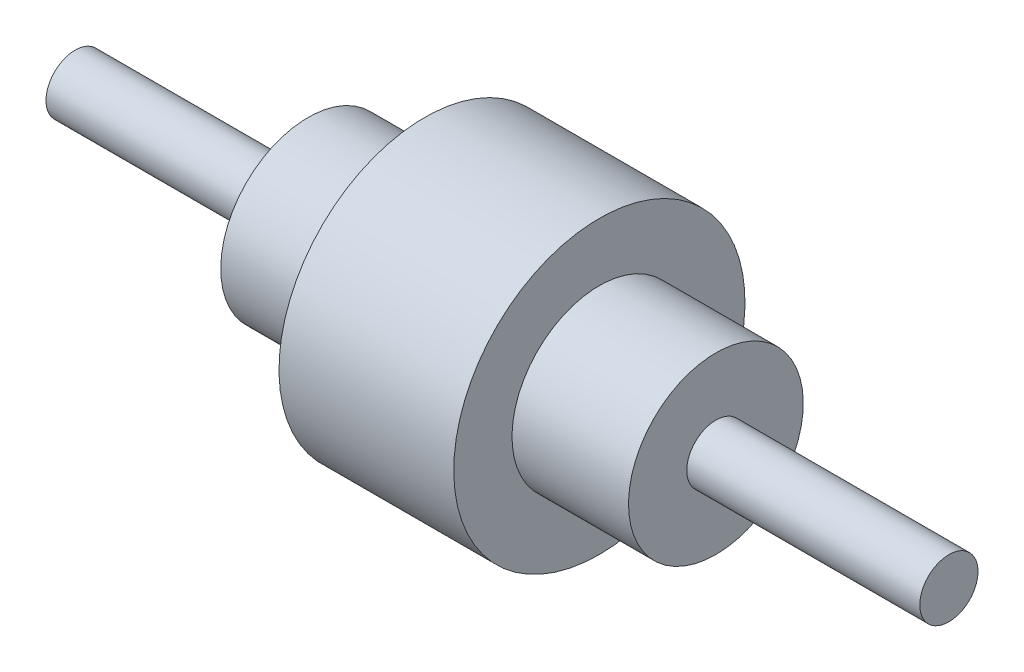
ISO-10303-21;
HEADER;
FILE_DESCRIPTION(('STEP AP214'),'2;1');
FILE_NAME('part.step','',(''),(''),'','','');
FILE_SCHEMA(('AUTOMOTIVE_DESIGN { 1 0 10303 214 1 1 1 1 }'));
ENDSEC;
DATA;
#1=APPLICATION_CONTEXT('core data for automotive mechanical design processes');
#2=APPLICATION_PROTOCOL_DEFINITION('international standard','automotive_design',2000,#1);
#3=PRODUCT_CONTEXT('',#1,'mechanical');
#4=PRODUCT('Part','Part','',(#3));
#5=PRODUCT_RELATED_PRODUCT_CATEGORY('part','',(#4));
#6=PRODUCT_DEFINITION_FORMATION('','',#4);
#7=PRODUCT_DEFINITION_CONTEXT('part definition',#1,'design');
#8=PRODUCT_DEFINITION('design','',#6,#7);
#9=PRODUCT_DEFINITION_SHAPE('','',#8);
#10=(LENGTH_UNIT() NAMED_UNIT(*) SI_UNIT(.MILLI.,.METRE.));
#11=(NAMED_UNIT(*) PLANE_ANGLE_UNIT() SI_UNIT($,.RADIAN.));
#12=(NAMED_UNIT(*) SI_UNIT($,.STERADIAN.) SOLID_ANGLE_UNIT());
#13=UNCERTAINTY_MEASURE_WITH_UNIT(LENGTH_MEASURE(1.E-05),#10,'distance_accuracy_value','');
#14=(GEOMETRIC_REPRESENTATION_CONTEXT(3) GLOBAL_UNCERTAINTY_ASSIGNED_CONTEXT((#13)) GLOBAL_UNIT_ASSIGNED_CONTEXT((#10,
#11,#12)) REPRESENTATION_CONTEXT('',''));
#15=CARTESIAN_POINT('',(0.,0.,0.));
#16=DIRECTION('',(0.,0.,1.));
#17=DIRECTION('',(1.,0.,0.));
#18=AXIS2_PLACEMENT_3D('',#15,#16,#17);
#19=CARTESIAN_POINT('',(-337.196685693784,0.,0.));
#20=DIRECTION('',(-1.,0.,0.));
#21=DIRECTION('',(0.,-1.,0.));
#22=AXIS2_PLACEMENT_3D('',#19,#20,#21);
#23=CYLINDRICAL_SURFACE('',#22,9.99999999999999);
#24=CARTESIAN_POINT('',(80.,0.,0.));
#25=DIRECTION('',(-1.,0.,0.));
#26=DIRECTION('',(0.,-1.,0.));
#27=AXIS2_PLACEMENT_3D('',#24,#25,#26);
#28=CIRCLE('',#27,9.99999999999999);
#29=CARTESIAN_POINT('',(80.,-10.,0.));
#30=VERTEX_POINT('',#29);
#31=EDGE_CURVE('E10',#30,#30,#28,.T.);
#32=ORIENTED_EDGE('',*,*,#31,.T.);
#33=EDGE_LOOP('',(#32));
#34=FACE_BOUND('',#33,.T.);
#35=CARTESIAN_POINT('',(0.,0.,0.));
#36=DIRECTION('',(-1.,0.,0.));
#37=DIRECTION('',(0.,-1.,0.));
#38=AXIS2_PLACEMENT_3D('',#35,#36,#37);
#39=CIRCLE('',#38,9.99999999999999);
#40=CARTESIAN_POINT('',(0.,-10.,0.));
#41=VERTEX_POINT('',#40);
#42=EDGE_CURVE('E65',#41,#41,#39,.T.);
#43=ORIENTED_EDGE('',*,*,#42,.F.);
#44=EDGE_LOOP('',(#43));
#45=FACE_BOUND('',#44,.T.);
#46=ADVANCED_FACE('F31',(#34,#45),#23,.T.);
#47=CARTESIAN_POINT('',(80.,-10.,0.));
#48=DIRECTION('',(1.,0.,0.));
#49=DIRECTION('',(0.,1.,0.));
#50=AXIS2_PLACEMENT_3D('',#47,#48,#49);
#51=PLANE('',#50);
#52=ORIENTED_EDGE('',*,*,#31,.F.);
#53=EDGE_LOOP('',(#52));
#54=FACE_BOUND('',#53,.T.);
#55=ADVANCED_FACE('F73',(#54),#51,.T.);
#56=CARTESIAN_POINT('',(-220.,0.,0.));
#57=DIRECTION('',(-1.,0.,0.));
#58=DIRECTION('',(0.,-1.,0.));
#59=AXIS2_PLACEMENT_3D('',#56,#57,#58);
#60=PLANE('',#59);
#61=CARTESIAN_POINT('',(-220.,0.,0.));
#62=DIRECTION('',(-1.,0.,0.));
#63=DIRECTION('',(0.,-1.,0.));
#64=AXIS2_PLACEMENT_3D('',#61,#62,#63);
#65=CIRCLE('',#64,10.);
#66=CARTESIAN_POINT('',(-220.,-10.,0.));
#67=VERTEX_POINT('',#66);
#68=EDGE_CURVE('E37',#67,#67,#65,.T.);
#69=ORIENTED_EDGE('',*,*,#68,.T.);
#70=EDGE_LOOP('',(#69));
#71=FACE_BOUND('',#70,.T.);
#72=ADVANCED_FACE('F77',(#71),#60,.T.);
#73=CARTESIAN_POINT('',(-337.196685693784,0.,0.));
#74=DIRECTION('',(-1.,0.,0.));
#75=DIRECTION('',(0.,-1.,0.));
#76=AXIS2_PLACEMENT_3D('',#73,#74,#75);
#77=CYLINDRICAL_SURFACE('',#76,10.);
#78=CARTESIAN_POINT('',(-140.,0.,0.));
#79=DIRECTION('',(-1.,0.,0.));
#80=DIRECTION('',(0.,-1.,0.));
#81=AXIS2_PLACEMENT_3D('',#78,#79,#80);
#82=CIRCLE('',#81,10.);
#83=CARTESIAN_POINT('',(-140.,-10.,0.));
#84=VERTEX_POINT('',#83);
#85=EDGE_CURVE('E41',#84,#84,#82,.T.);
#86=ORIENTED_EDGE('',*,*,#85,.T.);
#87=EDGE_LOOP('',(#86));
#88=FACE_BOUND('',#87,.T.);
#89=ORIENTED_EDGE('',*,*,#68,.F.);
#90=EDGE_LOOP('',(#89));
#91=FACE_BOUND('',#90,.T.);
#92=ADVANCED_FACE('F82',(#88,#91),#77,.T.);
#93=CARTESIAN_POINT('',(-140.,-10.,0.));
#94=DIRECTION('',(-1.,0.,0.));
#95=DIRECTION('',(0.,-1.,0.));
#96=AXIS2_PLACEMENT_3D('',#93,#94,#95);
#97=PLANE('',#96);
#98=CARTESIAN_POINT('',(-140.,0.,0.));
#99=DIRECTION('',(-1.,0.,0.));
#100=DIRECTION('',(0.,-1.,0.));
#101=AXIS2_PLACEMENT_3D('',#98,#99,#100);
#102=CIRCLE('',#101,30.);
#103=CARTESIAN_POINT('',(-140.,-30.,0.));
#104=VERTEX_POINT('',#103);
#105=EDGE_CURVE('E45',#104,#104,#102,.T.);
#106=ORIENTED_EDGE('',*,*,#105,.T.);
#107=EDGE_LOOP('',(#106));
#108=FACE_BOUND('',#107,.T.);
#109=ORIENTED_EDGE('',*,*,#85,.F.);
#110=EDGE_LOOP('',(#109));
#111=FACE_BOUND('',#110,.T.);
#112=ADVANCED_FACE('F87',(#108,#111),#97,.T.);
#113=CARTESIAN_POINT('',(-337.196685693784,0.,0.));
#114=DIRECTION('',(-1.,0.,0.));
#115=DIRECTION('',(0.,-1.,0.));
#116=AXIS2_PLACEMENT_3D('',#113,#114,#115);
#117=CYLINDRICAL_SURFACE('',#116,30.);
#118=CARTESIAN_POINT('',(-100.,0.,0.));
#119=DIRECTION('',(-1.,0.,0.));
#120=DIRECTION('',(0.,-1.,0.));
#121=AXIS2_PLACEMENT_3D('',#118,#119,#120);
#122=CIRCLE('',#121,30.);
#123=CARTESIAN_POINT('',(-100.,-30.,0.));
#124=VERTEX_POINT('',#123);
#125=EDGE_CURVE('E50',#124,#124,#122,.T.);
#126=ORIENTED_EDGE('',*,*,#125,.T.);
#127=EDGE_LOOP('',(#126));
#128=FACE_BOUND('',#127,.T.);
#129=ORIENTED_EDGE('',*,*,#105,.F.);
#130=EDGE_LOOP('',(#129));
#131=FACE_BOUND('',#130,.T.);
#132=ADVANCED_FACE('F91',(#128,#131),#117,.T.);
#133=CARTESIAN_POINT('',(-100.,-30.,0.));
#134=DIRECTION('',(-1.,0.,0.));
#135=DIRECTION('',(0.,-1.,0.));
#136=AXIS2_PLACEMENT_3D('',#133,#134,#135);
#137=PLANE('',#136);
#138=CARTESIAN_POINT('',(-100.,0.,0.));
#139=DIRECTION('',(-1.,0.,0.));
#140=DIRECTION('',(0.,-1.,0.));
#141=AXIS2_PLACEMENT_3D('',#138,#139,#140);
#142=CIRCLE('',#141,50.);
#143=CARTESIAN_POINT('',(-100.,-50.,0.));
#144=VERTEX_POINT('',#143);
#145=EDGE_CURVE('E53',#144,#144,#142,.T.);
#146=ORIENTED_EDGE('',*,*,#145,.T.);
#147=EDGE_LOOP('',(#146));
#148=FACE_BOUND('',#147,.T.);
#149=ORIENTED_EDGE('',*,*,#125,.F.);
#150=EDGE_LOOP('',(#149));
#151=FACE_BOUND('',#150,.T.);
#152=ADVANCED_FACE('F95',(#148,#151),#137,.T.);
#153=CARTESIAN_POINT('',(-337.196685693784,0.,0.));
#154=DIRECTION('',(-1.,0.,0.));
#155=DIRECTION('',(0.,-1.,0.));
#156=AXIS2_PLACEMENT_3D('',#153,#154,#155);
#157=CYLINDRICAL_SURFACE('',#156,50.);
#158=CARTESIAN_POINT('',(-40.,0.,0.));
#159=DIRECTION('',(-1.,0.,0.));
#160=DIRECTION('',(0.,-1.,0.));
#161=AXIS2_PLACEMENT_3D('',#158,#159,#160);
#162=CIRCLE('',#161,50.);
#163=CARTESIAN_POINT('',(-40.,-50.,0.));
#164=VERTEX_POINT('',#163);
#165=EDGE_CURVE('E56',#164,#164,#162,.T.);
#166=ORIENTED_EDGE('',*,*,#165,.T.);
#167=EDGE_LOOP('',(#166));
#168=FACE_BOUND('',#167,.T.);
#169=ORIENTED_EDGE('',*,*,#145,.F.);
#170=EDGE_LOOP('',(#169));
#171=FACE_BOUND('',#170,.T.);
#172=ADVANCED_FACE('F99',(#168,#171),#157,.T.);
#173=CARTESIAN_POINT('',(-40.,-30.,0.));
#174=DIRECTION('',(1.,0.,0.));
#175=DIRECTION('',(0.,1.,0.));
#176=AXIS2_PLACEMENT_3D('',#173,#174,#175);
#177=PLANE('',#176);
#178=CARTESIAN_POINT('',(-40.,0.,0.));
#179=DIRECTION('',(-1.,0.,0.));
#180=DIRECTION('',(0.,-1.,0.));
#181=AXIS2_PLACEMENT_3D('',#178,#179,#180);
#182=CIRCLE('',#181,30.);
#183=CARTESIAN_POINT('',(-40.,-30.,0.));
#184=VERTEX_POINT('',#183);
#185=EDGE_CURVE('E59',#184,#184,#182,.T.);
#186=ORIENTED_EDGE('',*,*,#185,.T.);
#187=EDGE_LOOP('',(#186));
#188=FACE_BOUND('',#187,.T.);
#189=ORIENTED_EDGE('',*,*,#165,.F.);
#190=EDGE_LOOP('',(#189));
#191=FACE_BOUND('',#190,.T.);
#192=ADVANCED_FACE('F103',(#188,#191),#177,.T.);
#193=CARTESIAN_POINT('',(-337.196685693784,0.,0.));
#194=DIRECTION('',(-1.,0.,0.));
#195=DIRECTION('',(0.,-1.,0.));
#196=AXIS2_PLACEMENT_3D('',#193,#194,#195);
#197=CYLINDRICAL_SURFACE('',#196,30.);
#198=CARTESIAN_POINT('',(0.,0.,0.));
#199=DIRECTION('',(-1.,0.,0.));
#200=DIRECTION('',(0.,-1.,0.));
#201=AXIS2_PLACEMENT_3D('',#198,#199,#200);
#202=CIRCLE('',#201,30.);
#203=CARTESIAN_POINT('',(0.,-30.,0.));
#204=VERTEX_POINT('',#203);
#205=EDGE_CURVE('E62',#204,#204,#202,.T.);
#206=ORIENTED_EDGE('',*,*,#205,.T.);
#207=EDGE_LOOP('',(#206));
#208=FACE_BOUND('',#207,.T.);
#209=ORIENTED_EDGE('',*,*,#185,.F.);
#210=EDGE_LOOP('',(#209));
#211=FACE_BOUND('',#210,.T.);
#212=ADVANCED_FACE('F107',(#208,#211),#197,.T.);
#213=CARTESIAN_POINT('',(0.,-10.,0.));
#214=DIRECTION('',(1.,0.,0.));
#215=DIRECTION('',(0.,1.,0.));
#216=AXIS2_PLACEMENT_3D('',#213,#214,#215);
#217=PLANE('',#216);
#218=ORIENTED_EDGE('',*,*,#42,.T.);
#219=EDGE_LOOP('',(#218));
#220=FACE_BOUND('',#219,.T.);
#221=ORIENTED_EDGE('',*,*,#205,.F.);
#222=EDGE_LOOP('',(#221));
#223=FACE_BOUND('',#222,.T.);
#224=ADVANCED_FACE('F69',(#220,#223),#217,.T.);
#225=CLOSED_SHELL('',(#46,#55,#72,#92,#112,#132,#152,#172,#192,#212,#224));
#226=MANIFOLD_SOLID_BREP('B2',#225);
#227=ADVANCED_BREP_SHAPE_REPRESENTATION('',(#18,#226),#14);
#228=SHAPE_DEFINITION_REPRESENTATION(#9,#227);
ENDSEC;
END-ISO-10303-21;
